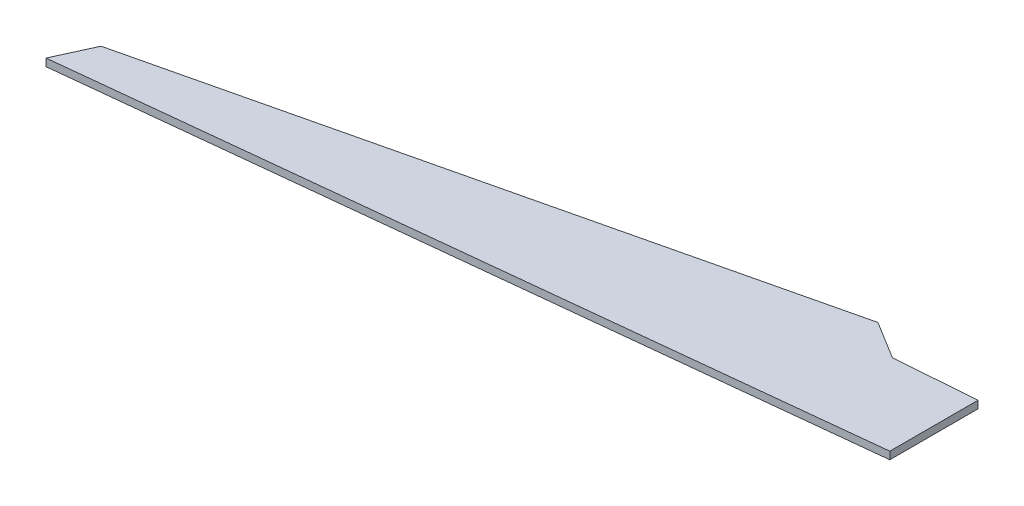
ISO-10303-21;
HEADER;
FILE_DESCRIPTION(('STEP AP214'),'2;1');
FILE_NAME('part.step','',(''),(''),'','','');
FILE_SCHEMA(('AUTOMOTIVE_DESIGN { 1 0 10303 214 1 1 1 1 }'));
ENDSEC;
DATA;
#1=APPLICATION_CONTEXT('core data for automotive mechanical design processes');
#2=APPLICATION_PROTOCOL_DEFINITION('international standard','automotive_design',2000,#1);
#3=PRODUCT_CONTEXT('',#1,'mechanical');
#4=PRODUCT('Part','Part','',(#3));
#5=PRODUCT_RELATED_PRODUCT_CATEGORY('part','',(#4));
#6=PRODUCT_DEFINITION_FORMATION('','',#4);
#7=PRODUCT_DEFINITION_CONTEXT('part definition',#1,'design');
#8=PRODUCT_DEFINITION('design','',#6,#7);
#9=PRODUCT_DEFINITION_SHAPE('','',#8);
#10=(LENGTH_UNIT() NAMED_UNIT(*) SI_UNIT(.MILLI.,.METRE.));
#11=(NAMED_UNIT(*) PLANE_ANGLE_UNIT() SI_UNIT($,.RADIAN.));
#12=(NAMED_UNIT(*) SI_UNIT($,.STERADIAN.) SOLID_ANGLE_UNIT());
#13=UNCERTAINTY_MEASURE_WITH_UNIT(LENGTH_MEASURE(1.E-05),#10,'distance_accuracy_value','');
#14=(GEOMETRIC_REPRESENTATION_CONTEXT(3) GLOBAL_UNCERTAINTY_ASSIGNED_CONTEXT((#13)) GLOBAL_UNIT_ASSIGNED_CONTEXT((#10,
#11,#12)) REPRESENTATION_CONTEXT('',''));
#15=CARTESIAN_POINT('',(0.,0.,0.));
#16=DIRECTION('',(0.,0.,1.));
#17=DIRECTION('',(1.,0.,0.));
#18=AXIS2_PLACEMENT_3D('',#15,#16,#17);
#19=CARTESIAN_POINT('',(102.114472391951,75.,-894.615188824914));
#20=DIRECTION('',(-1.,0.,0.));
#21=DIRECTION('',(0.,0.,1.));
#22=AXIS2_PLACEMENT_3D('',#19,#20,#21);
#23=PLANE('',#22);
#24=DIRECTION('',(0.,0.,-1.));
#25=VECTOR('',#24,1.);
#26=CARTESIAN_POINT('',(102.114472391951,0.,-894.615188824914));
#27=LINE('',#26,#25);
#28=CARTESIAN_POINT('',(102.114472391948,0.,-10.9128889657111));
#29=VERTEX_POINT('',#28);
#30=CARTESIAN_POINT('',(102.114472391951,0.,-894.615188824914));
#31=VERTEX_POINT('',#30);
#32=EDGE_CURVE('E125',#29,#31,#27,.T.);
#33=ORIENTED_EDGE('',*,*,#32,.T.);
#34=DIRECTION('',(0.,-1.,0.));
#35=VECTOR('',#34,1.);
#36=CARTESIAN_POINT('',(102.114472391951,75.,-894.615188824914));
#37=LINE('',#36,#35);
#38=CARTESIAN_POINT('',(102.114472391951,75.,-894.615188824914));
#39=VERTEX_POINT('',#38);
#40=EDGE_CURVE('E45',#39,#31,#37,.T.);
#41=ORIENTED_EDGE('',*,*,#40,.F.);
#42=DIRECTION('',(0.,0.,-1.));
#43=VECTOR('',#42,1.);
#44=CARTESIAN_POINT('',(102.114472391951,75.,-894.615188824914));
#45=LINE('',#44,#43);
#46=CARTESIAN_POINT('',(102.114472391948,75.,-10.9128889657111));
#47=VERTEX_POINT('',#46);
#48=EDGE_CURVE('E91',#47,#39,#45,.T.);
#49=ORIENTED_EDGE('',*,*,#48,.F.);
#50=DIRECTION('',(0.,-1.,0.));
#51=VECTOR('',#50,1.);
#52=CARTESIAN_POINT('',(102.114472391948,75.,-10.9128889657111));
#53=LINE('',#52,#51);
#54=EDGE_CURVE('E11',#47,#29,#53,.T.);
#55=ORIENTED_EDGE('',*,*,#54,.T.);
#56=EDGE_LOOP('',(#33,#41,#49,#55));
#57=FACE_BOUND('',#56,.T.);
#58=ADVANCED_FACE('F37',(#57),#23,.F.);
#59=CARTESIAN_POINT('',(-695.657742480766,75.,-834.953700601111));
#60=DIRECTION('',(0.0745768602797542,0.,0.997215268590897));
#61=DIRECTION('',(0.997215268590897,0.,-0.0745768602797542));
#62=AXIS2_PLACEMENT_3D('',#59,#60,#61);
#63=PLANE('',#62);
#64=DIRECTION('',(-0.997215268590897,0.,0.0745768602797542));
#65=VECTOR('',#64,1.);
#66=CARTESIAN_POINT('',(-695.657742480766,0.,-834.953700601111));
#67=LINE('',#66,#65);
#68=CARTESIAN_POINT('',(-695.657742480766,0.,-834.953700601111));
#69=VERTEX_POINT('',#68);
#70=EDGE_CURVE('E127',#31,#69,#67,.T.);
#71=ORIENTED_EDGE('',*,*,#70,.T.);
#72=DIRECTION('',(0.,-1.,0.));
#73=VECTOR('',#72,1.);
#74=CARTESIAN_POINT('',(-695.657742480766,75.,-834.953700601111));
#75=LINE('',#74,#73);
#76=CARTESIAN_POINT('',(-695.657742480766,75.,-834.953700601111));
#77=VERTEX_POINT('',#76);
#78=EDGE_CURVE('E114',#77,#69,#75,.T.);
#79=ORIENTED_EDGE('',*,*,#78,.F.);
#80=DIRECTION('',(-0.997215268590897,0.,0.0745768602797542));
#81=VECTOR('',#80,1.);
#82=CARTESIAN_POINT('',(-695.657742480766,75.,-834.953700601111));
#83=LINE('',#82,#81);
#84=EDGE_CURVE('E105',#39,#77,#83,.T.);
#85=ORIENTED_EDGE('',*,*,#84,.F.);
#86=ORIENTED_EDGE('',*,*,#40,.T.);
#87=EDGE_LOOP('',(#71,#79,#85,#86));
#88=FACE_BOUND('',#87,.T.);
#89=ADVANCED_FACE('F139',(#88),#63,.F.);
#90=CARTESIAN_POINT('',(-1074.55941593396,75.,-1068.31719786314));
#91=DIRECTION('',(-0.524412353397824,0.,0.851464434726287));
#92=DIRECTION('',(0.851464434726287,0.,0.524412353397824));
#93=AXIS2_PLACEMENT_3D('',#90,#91,#92);
#94=PLANE('',#93);
#95=DIRECTION('',(-0.851464434726287,0.,-0.524412353397824));
#96=VECTOR('',#95,1.);
#97=CARTESIAN_POINT('',(-1074.55941593396,0.,-1068.31719786314));
#98=LINE('',#97,#96);
#99=CARTESIAN_POINT('',(-1074.55941593396,0.,-1068.31719786314));
#100=VERTEX_POINT('',#99);
#101=EDGE_CURVE('E113',#69,#100,#98,.T.);
#102=ORIENTED_EDGE('',*,*,#101,.T.);
#103=DIRECTION('',(0.,-1.,0.));
#104=VECTOR('',#103,1.);
#105=CARTESIAN_POINT('',(-1074.55941593396,75.,-1068.31719786314));
#106=LINE('',#105,#104);
#107=CARTESIAN_POINT('',(-1074.55941593396,75.,-1068.31719786314));
#108=VERTEX_POINT('',#107);
#109=EDGE_CURVE('E110',#108,#100,#106,.T.);
#110=ORIENTED_EDGE('',*,*,#109,.F.);
#111=DIRECTION('',(-0.851464434726287,0.,-0.524412353397824));
#112=VECTOR('',#111,1.);
#113=CARTESIAN_POINT('',(-1074.55941593396,75.,-1068.31719786314));
#114=LINE('',#113,#112);
#115=EDGE_CURVE('E99',#77,#108,#114,.T.);
#116=ORIENTED_EDGE('',*,*,#115,.F.);
#117=ORIENTED_EDGE('',*,*,#78,.T.);
#118=EDGE_LOOP('',(#102,#110,#116,#117));
#119=FACE_BOUND('',#118,.T.);
#120=ADVANCED_FACE('F111',(#119),#94,.F.);
#121=CARTESIAN_POINT('',(-7364.30494792861,75.,426.783515384431));
#122=DIRECTION('',(0.231260744508519,0.,0.972891806959729));
#123=DIRECTION('',(0.972891806959729,0.,-0.231260744508519));
#124=AXIS2_PLACEMENT_3D('',#121,#122,#123);
#125=PLANE('',#124);
#126=DIRECTION('',(-0.972891806959728,0.,0.231260744508519));
#127=VECTOR('',#126,1.);
#128=CARTESIAN_POINT('',(-7364.30494792861,0.,426.783515384431));
#129=LINE('',#128,#127);
#130=CARTESIAN_POINT('',(-7364.30494792861,0.,426.783515384431));
#131=VERTEX_POINT('',#130);
#132=EDGE_CURVE('E77',#100,#131,#129,.T.);
#133=ORIENTED_EDGE('',*,*,#132,.T.);
#134=DIRECTION('',(0.,-1.,0.));
#135=VECTOR('',#134,1.);
#136=CARTESIAN_POINT('',(-7364.30494792861,75.,426.783515384431));
#137=LINE('',#136,#135);
#138=CARTESIAN_POINT('',(-7364.30494792861,75.,426.783515384431));
#139=VERTEX_POINT('',#138);
#140=EDGE_CURVE('E115',#139,#131,#137,.T.);
#141=ORIENTED_EDGE('',*,*,#140,.F.);
#142=DIRECTION('',(-0.972891806959728,0.,0.231260744508519));
#143=VECTOR('',#142,1.);
#144=CARTESIAN_POINT('',(-7364.30494792861,75.,426.783515384431));
#145=LINE('',#144,#143);
#146=EDGE_CURVE('E103',#108,#139,#145,.T.);
#147=ORIENTED_EDGE('',*,*,#146,.F.);
#148=ORIENTED_EDGE('',*,*,#109,.T.);
#149=EDGE_LOOP('',(#133,#141,#147,#148));
#150=FACE_BOUND('',#149,.T.);
#151=ADVANCED_FACE('F117',(#150),#125,.F.);
#152=CARTESIAN_POINT('',(-7537.0816165297,75.,805.481660728596));
#153=DIRECTION('',(0.909785334160154,0.,0.415079083726338));
#154=DIRECTION('',(0.415079083726338,0.,-0.909785334160154));
#155=AXIS2_PLACEMENT_3D('',#152,#153,#154);
#156=PLANE('',#155);
#157=DIRECTION('',(-0.415079083726338,0.,0.909785334160154));
#158=VECTOR('',#157,1.);
#159=CARTESIAN_POINT('',(-7537.0816165297,0.,805.481660728596));
#160=LINE('',#159,#158);
#161=CARTESIAN_POINT('',(-7537.0816165297,0.,805.481660728596));
#162=VERTEX_POINT('',#161);
#163=EDGE_CURVE('E84',#131,#162,#160,.T.);
#164=ORIENTED_EDGE('',*,*,#163,.T.);
#165=DIRECTION('',(0.,-1.,0.));
#166=VECTOR('',#165,1.);
#167=CARTESIAN_POINT('',(-7537.0816165297,75.,805.481660728596));
#168=LINE('',#167,#166);
#169=CARTESIAN_POINT('',(-7537.0816165297,75.,805.481660728596));
#170=VERTEX_POINT('',#169);
#171=EDGE_CURVE('E121',#170,#162,#168,.T.);
#172=ORIENTED_EDGE('',*,*,#171,.F.);
#173=DIRECTION('',(-0.415079083726338,0.,0.909785334160154));
#174=VECTOR('',#173,1.);
#175=CARTESIAN_POINT('',(-7537.0816165297,75.,805.481660728596));
#176=LINE('',#175,#174);
#177=EDGE_CURVE('E119',#139,#170,#176,.T.);
#178=ORIENTED_EDGE('',*,*,#177,.F.);
#179=ORIENTED_EDGE('',*,*,#140,.T.);
#180=EDGE_LOOP('',(#164,#172,#178,#179));
#181=FACE_BOUND('',#180,.T.);
#182=ADVANCED_FACE('F145',(#181),#156,.F.);
#183=CARTESIAN_POINT('',(0.,75.,0.));
#184=DIRECTION('',(-0.106264071336226,0.,-0.994337944133205));
#185=DIRECTION('',(-0.994337944133206,0.,0.106264071336226));
#186=AXIS2_PLACEMENT_3D('',#183,#184,#185);
#187=PLANE('',#186);
#188=DIRECTION('',(0.994337944133205,0.,-0.106264071336226));
#189=VECTOR('',#188,1.);
#190=CARTESIAN_POINT('',(0.,0.,0.));
#191=LINE('',#190,#189);
#192=EDGE_CURVE('E132',#162,#29,#191,.T.);
#193=ORIENTED_EDGE('',*,*,#192,.T.);
#194=ORIENTED_EDGE('',*,*,#54,.F.);
#195=DIRECTION('',(0.994337944133205,0.,-0.106264071336226));
#196=VECTOR('',#195,1.);
#197=CARTESIAN_POINT('',(0.,75.,0.));
#198=LINE('',#197,#196);
#199=EDGE_CURVE('E53',#170,#47,#198,.T.);
#200=ORIENTED_EDGE('',*,*,#199,.F.);
#201=ORIENTED_EDGE('',*,*,#171,.T.);
#202=EDGE_LOOP('',(#193,#194,#200,#201));
#203=FACE_BOUND('',#202,.T.);
#204=ADVANCED_FACE('F144',(#203),#187,.F.);
#205=CARTESIAN_POINT('',(0.,75.,0.));
#206=DIRECTION('',(0.,-1.,0.));
#207=DIRECTION('',(0.,0.,-1.));
#208=AXIS2_PLACEMENT_3D('',#205,#206,#207);
#209=PLANE('',#208);
#210=ORIENTED_EDGE('',*,*,#199,.T.);
#211=ORIENTED_EDGE('',*,*,#48,.T.);
#212=ORIENTED_EDGE('',*,*,#84,.T.);
#213=ORIENTED_EDGE('',*,*,#115,.T.);
#214=ORIENTED_EDGE('',*,*,#146,.T.);
#215=ORIENTED_EDGE('',*,*,#177,.T.);
#216=EDGE_LOOP('',(#210,#211,#212,#213,#214,#215));
#217=FACE_BOUND('',#216,.T.);
#218=ADVANCED_FACE('F101',(#217),#209,.F.);
#219=CARTESIAN_POINT('',(0.,0.,0.));
#220=DIRECTION('',(0.,-1.,0.));
#221=DIRECTION('',(0.,0.,-1.));
#222=AXIS2_PLACEMENT_3D('',#219,#220,#221);
#223=PLANE('',#222);
#224=ORIENTED_EDGE('',*,*,#32,.F.);
#225=ORIENTED_EDGE('',*,*,#192,.F.);
#226=ORIENTED_EDGE('',*,*,#163,.F.);
#227=ORIENTED_EDGE('',*,*,#132,.F.);
#228=ORIENTED_EDGE('',*,*,#101,.F.);
#229=ORIENTED_EDGE('',*,*,#70,.F.);
#230=EDGE_LOOP('',(#224,#225,#226,#227,#228,#229));
#231=FACE_BOUND('',#230,.T.);
#232=ADVANCED_FACE('F142',(#231),#223,.T.);
#233=CLOSED_SHELL('',(#58,#89,#120,#151,#182,#204,#218,#232));
#234=MANIFOLD_SOLID_BREP('B2',#233);
#235=ADVANCED_BREP_SHAPE_REPRESENTATION('',(#18,#234),#14);
#236=SHAPE_DEFINITION_REPRESENTATION(#9,#235);
ENDSEC;
END-ISO-10303-21;
